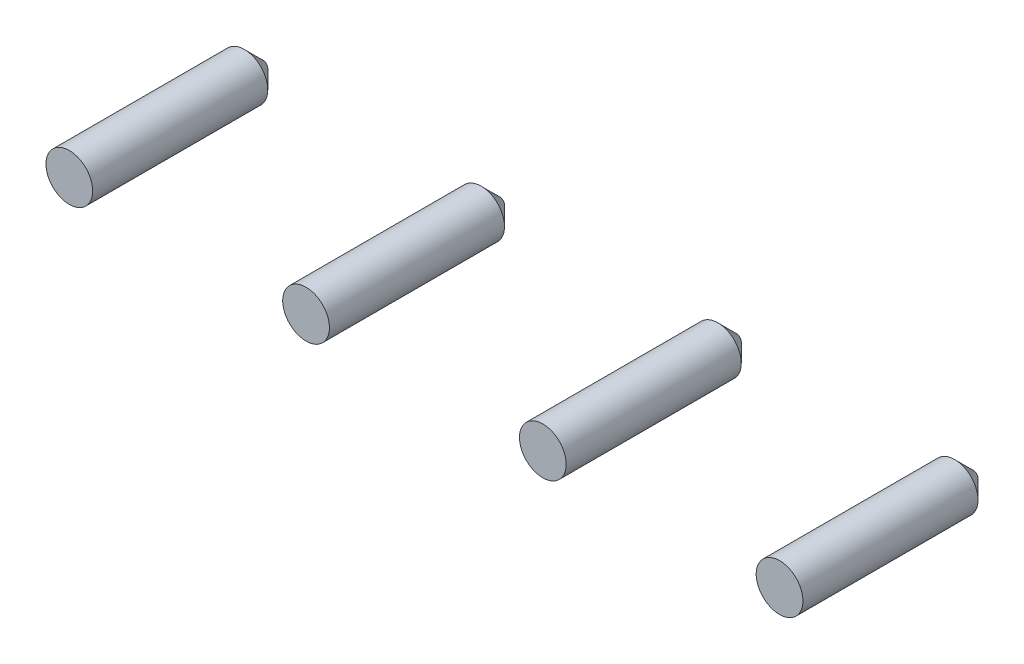
ISO-10303-21;
HEADER;
FILE_DESCRIPTION(('STEP AP214'),'2;1');
FILE_NAME('part.step','',(''),(''),'','','');
FILE_SCHEMA(('AUTOMOTIVE_DESIGN { 1 0 10303 214 1 1 1 1 }'));
ENDSEC;
DATA;
#1=APPLICATION_CONTEXT('core data for automotive mechanical design processes');
#2=APPLICATION_PROTOCOL_DEFINITION('international standard','automotive_design',2000,#1);
#3=PRODUCT_CONTEXT('',#1,'mechanical');
#4=PRODUCT('Part','Part','',(#3));
#5=PRODUCT_RELATED_PRODUCT_CATEGORY('part','',(#4));
#6=PRODUCT_DEFINITION_FORMATION('','',#4);
#7=PRODUCT_DEFINITION_CONTEXT('part definition',#1,'design');
#8=PRODUCT_DEFINITION('design','',#6,#7);
#9=PRODUCT_DEFINITION_SHAPE('','',#8);
#10=(LENGTH_UNIT() NAMED_UNIT(*) SI_UNIT(.MILLI.,.METRE.));
#11=(NAMED_UNIT(*) PLANE_ANGLE_UNIT() SI_UNIT($,.RADIAN.));
#12=(NAMED_UNIT(*) SI_UNIT($,.STERADIAN.) SOLID_ANGLE_UNIT());
#13=UNCERTAINTY_MEASURE_WITH_UNIT(LENGTH_MEASURE(1.E-05),#10,'distance_accuracy_value','');
#14=(GEOMETRIC_REPRESENTATION_CONTEXT(3) GLOBAL_UNCERTAINTY_ASSIGNED_CONTEXT((#13)) GLOBAL_UNIT_ASSIGNED_CONTEXT((#10,
#11,#12)) REPRESENTATION_CONTEXT('',''));
#15=CARTESIAN_POINT('',(0.,0.,0.));
#16=DIRECTION('',(0.,0.,1.));
#17=DIRECTION('',(1.,0.,0.));
#18=AXIS2_PLACEMENT_3D('',#15,#16,#17);
#19=CARTESIAN_POINT('',(0.,0.,-4.064));
#20=DIRECTION('',(0.,0.,1.));
#21=DIRECTION('',(1.,0.,0.));
#22=AXIS2_PLACEMENT_3D('',#19,#20,#21);
#23=PLANE('',#22);
#24=CARTESIAN_POINT('',(0.,0.,-4.064));
#25=DIRECTION('',(0.,0.,1.));
#26=DIRECTION('',(1.,0.,0.));
#27=AXIS2_PLACEMENT_3D('',#24,#25,#26);
#28=CIRCLE('',#27,0.1629);
#29=CARTESIAN_POINT('',(0.1629,0.,-4.064));
#30=VERTEX_POINT('',#29);
#31=EDGE_CURVE('P0_E19',#30,#30,#28,.T.);
#32=ORIENTED_EDGE('',*,*,#31,.F.);
#33=EDGE_LOOP('',(#32));
#34=FACE_BOUND('',#33,.T.);
#35=ADVANCED_FACE('P0_F16',(#34),#23,.F.);
#36=CARTESIAN_POINT('',(0.,0.,2.6924));
#37=DIRECTION('',(0.,0.,1.));
#38=DIRECTION('',(1.,0.,0.));
#39=AXIS2_PLACEMENT_3D('',#36,#37,#38);
#40=PLANE('',#39);
#41=CARTESIAN_POINT('',(0.,0.,2.6924));
#42=DIRECTION('',(0.,0.,1.));
#43=DIRECTION('',(1.,0.,0.));
#44=AXIS2_PLACEMENT_3D('',#41,#42,#43);
#45=CIRCLE('',#44,0.8145);
#46=CARTESIAN_POINT('',(0.8145,0.,2.6924));
#47=VERTEX_POINT('',#46);
#48=EDGE_CURVE('P0_E44',#47,#47,#45,.T.);
#49=ORIENTED_EDGE('',*,*,#48,.T.);
#50=EDGE_LOOP('',(#49));
#51=FACE_BOUND('',#50,.T.);
#52=ADVANCED_FACE('P0_F86',(#51),#40,.T.);
#53=CARTESIAN_POINT('',(0.,0.,-3.4124));
#54=DIRECTION('',(0.,0.,1.));
#55=DIRECTION('',(1.,0.,0.));
#56=AXIS2_PLACEMENT_3D('',#53,#54,#55);
#57=CONICAL_SURFACE('',#56,0.8145,0.785398163397);
#58=ORIENTED_EDGE('',*,*,#31,.T.);
#59=DIRECTION('',(-0.707106781186548,0.,-0.707106781186548));
#60=VECTOR('',#59,1.);
#61=CARTESIAN_POINT('',(0.8145,0.,-3.4124));
#62=LINE('',#61,#60);
#63=CARTESIAN_POINT('',(0.8145,0.,-3.4124));
#64=VERTEX_POINT('',#63);
#65=EDGE_CURVE('P0_E11',#64,#30,#62,.T.);
#66=ORIENTED_EDGE('',*,*,#65,.F.);
#67=CARTESIAN_POINT('',(0.,0.,-3.4124));
#68=DIRECTION('',(0.,0.,1.));
#69=DIRECTION('',(1.,0.,0.));
#70=AXIS2_PLACEMENT_3D('',#67,#68,#69);
#71=CIRCLE('',#70,0.8145);
#72=EDGE_CURVE('P0_E48',#64,#64,#71,.T.);
#73=ORIENTED_EDGE('',*,*,#72,.F.);
#74=ORIENTED_EDGE('',*,*,#65,.T.);
#75=EDGE_LOOP('',(#58,#66,#73,#74));
#76=FACE_BOUND('',#75,.T.);
#77=ADVANCED_FACE('P0_F47',(#76),#57,.T.);
#78=CARTESIAN_POINT('',(0.,0.,-4.064));
#79=DIRECTION('',(0.,0.,1.));
#80=DIRECTION('',(1.,0.,0.));
#81=AXIS2_PLACEMENT_3D('',#78,#79,#80);
#82=CYLINDRICAL_SURFACE('',#81,0.8145);
#83=DIRECTION('',(0.,0.,1.));
#84=VECTOR('',#83,1.);
#85=CARTESIAN_POINT('',(0.8145,0.,-4.064));
#86=LINE('',#85,#84);
#87=EDGE_CURVE('P0_E54',#64,#47,#86,.T.);
#88=ORIENTED_EDGE('',*,*,#87,.T.);
#89=ORIENTED_EDGE('',*,*,#48,.F.);
#90=ORIENTED_EDGE('',*,*,#87,.F.);
#91=ORIENTED_EDGE('',*,*,#72,.T.);
#92=EDGE_LOOP('',(#88,#89,#90,#91));
#93=FACE_BOUND('',#92,.T.);
#94=ADVANCED_FACE('P0_F53',(#93),#82,.T.);
#95=CLOSED_SHELL('',(#35,#52,#77,#94));
#96=MANIFOLD_SOLID_BREP('P0_B1',#95);
#97=CARTESIAN_POINT('',(8.255,0.,-4.064));
#98=DIRECTION('',(0.,0.,1.));
#99=DIRECTION('',(1.,0.,0.));
#100=AXIS2_PLACEMENT_3D('',#97,#98,#99);
#101=PLANE('',#100);
#102=CARTESIAN_POINT('',(8.255,0.,-4.064));
#103=DIRECTION('',(0.,0.,1.));
#104=DIRECTION('',(1.,0.,0.));
#105=AXIS2_PLACEMENT_3D('',#102,#103,#104);
#106=CIRCLE('',#105,0.1629);
#107=CARTESIAN_POINT('',(8.4179,0.,-4.064));
#108=VERTEX_POINT('',#107);
#109=EDGE_CURVE('P1_E26',#108,#108,#106,.T.);
#110=ORIENTED_EDGE('',*,*,#109,.F.);
#111=EDGE_LOOP('',(#110));
#112=FACE_BOUND('',#111,.T.);
#113=ADVANCED_FACE('P1_F16',(#112),#101,.F.);
#114=CARTESIAN_POINT('',(8.255,0.,2.6924));
#115=DIRECTION('',(0.,0.,1.));
#116=DIRECTION('',(1.,0.,0.));
#117=AXIS2_PLACEMENT_3D('',#114,#115,#116);
#118=PLANE('',#117);
#119=CARTESIAN_POINT('',(8.255,0.,2.6924));
#120=DIRECTION('',(0.,0.,1.));
#121=DIRECTION('',(1.,0.,0.));
#122=AXIS2_PLACEMENT_3D('',#119,#120,#121);
#123=CIRCLE('',#122,0.8145);
#124=CARTESIAN_POINT('',(9.0695,0.,2.6924));
#125=VERTEX_POINT('',#124);
#126=EDGE_CURVE('P1_E44',#125,#125,#123,.T.);
#127=ORIENTED_EDGE('',*,*,#126,.T.);
#128=EDGE_LOOP('',(#127));
#129=FACE_BOUND('',#128,.T.);
#130=ADVANCED_FACE('P1_F83',(#129),#118,.T.);
#131=CARTESIAN_POINT('',(8.255,0.,-3.4124));
#132=DIRECTION('',(0.,0.,1.));
#133=DIRECTION('',(1.,0.,0.));
#134=AXIS2_PLACEMENT_3D('',#131,#132,#133);
#135=CONICAL_SURFACE('',#134,0.8145,0.785398163397);
#136=ORIENTED_EDGE('',*,*,#109,.T.);
#137=DIRECTION('',(-0.707106781186548,0.,-0.707106781186548));
#138=VECTOR('',#137,1.);
#139=CARTESIAN_POINT('',(9.0695,0.,-3.4124));
#140=LINE('',#139,#138);
#141=CARTESIAN_POINT('',(9.0695,0.,-3.4124));
#142=VERTEX_POINT('',#141);
#143=EDGE_CURVE('P1_E11',#142,#108,#140,.T.);
#144=ORIENTED_EDGE('',*,*,#143,.F.);
#145=CARTESIAN_POINT('',(8.255,0.,-3.4124));
#146=DIRECTION('',(0.,0.,1.));
#147=DIRECTION('',(1.,0.,0.));
#148=AXIS2_PLACEMENT_3D('',#145,#146,#147);
#149=CIRCLE('',#148,0.8145);
#150=EDGE_CURVE('P1_E49',#142,#142,#149,.T.);
#151=ORIENTED_EDGE('',*,*,#150,.F.);
#152=ORIENTED_EDGE('',*,*,#143,.T.);
#153=EDGE_LOOP('',(#136,#144,#151,#152));
#154=FACE_BOUND('',#153,.T.);
#155=ADVANCED_FACE('P1_F48',(#154),#135,.T.);
#156=CARTESIAN_POINT('',(8.255,0.,-4.064));
#157=DIRECTION('',(0.,0.,1.));
#158=DIRECTION('',(1.,0.,0.));
#159=AXIS2_PLACEMENT_3D('',#156,#157,#158);
#160=CYLINDRICAL_SURFACE('',#159,0.8145);
#161=DIRECTION('',(0.,0.,1.));
#162=VECTOR('',#161,1.);
#163=CARTESIAN_POINT('',(9.0695,0.,-4.064));
#164=LINE('',#163,#162);
#165=EDGE_CURVE('P1_E19',#142,#125,#164,.T.);
#166=ORIENTED_EDGE('',*,*,#165,.T.);
#167=ORIENTED_EDGE('',*,*,#126,.F.);
#168=ORIENTED_EDGE('',*,*,#165,.F.);
#169=ORIENTED_EDGE('',*,*,#150,.T.);
#170=EDGE_LOOP('',(#166,#167,#168,#169));
#171=FACE_BOUND('',#170,.T.);
#172=ADVANCED_FACE('P1_F54',(#171),#160,.T.);
#173=CLOSED_SHELL('',(#113,#130,#155,#172));
#174=MANIFOLD_SOLID_BREP('P1_B1',#173);
#175=CARTESIAN_POINT('',(16.51,0.,-4.064));
#176=DIRECTION('',(0.,0.,1.));
#177=DIRECTION('',(1.,0.,0.));
#178=AXIS2_PLACEMENT_3D('',#175,#176,#177);
#179=PLANE('',#178);
#180=CARTESIAN_POINT('',(16.51,0.,-4.064));
#181=DIRECTION('',(0.,0.,1.));
#182=DIRECTION('',(1.,0.,0.));
#183=AXIS2_PLACEMENT_3D('',#180,#181,#182);
#184=CIRCLE('',#183,0.1629);
#185=CARTESIAN_POINT('',(16.6729,0.,-4.064));
#186=VERTEX_POINT('',#185);
#187=EDGE_CURVE('P2_E20',#186,#186,#184,.T.);
#188=ORIENTED_EDGE('',*,*,#187,.F.);
#189=EDGE_LOOP('',(#188));
#190=FACE_BOUND('',#189,.T.);
#191=ADVANCED_FACE('P2_F16',(#190),#179,.F.);
#192=CARTESIAN_POINT('',(16.51,0.,2.6924));
#193=DIRECTION('',(0.,0.,1.));
#194=DIRECTION('',(1.,0.,0.));
#195=AXIS2_PLACEMENT_3D('',#192,#193,#194);
#196=PLANE('',#195);
#197=CARTESIAN_POINT('',(16.51,0.,2.6924));
#198=DIRECTION('',(0.,0.,1.));
#199=DIRECTION('',(1.,0.,0.));
#200=AXIS2_PLACEMENT_3D('',#197,#198,#199);
#201=CIRCLE('',#200,0.8145);
#202=CARTESIAN_POINT('',(17.3245,0.,2.6924));
#203=VERTEX_POINT('',#202);
#204=EDGE_CURVE('P2_E45',#203,#203,#201,.T.);
#205=ORIENTED_EDGE('',*,*,#204,.T.);
#206=EDGE_LOOP('',(#205));
#207=FACE_BOUND('',#206,.T.);
#208=ADVANCED_FACE('P2_F18',(#207),#196,.T.);
#209=CARTESIAN_POINT('',(16.51,0.,-3.4124));
#210=DIRECTION('',(0.,0.,1.));
#211=DIRECTION('',(1.,0.,0.));
#212=AXIS2_PLACEMENT_3D('',#209,#210,#211);
#213=CONICAL_SURFACE('',#212,0.8145,0.785398163397);
#214=ORIENTED_EDGE('',*,*,#187,.T.);
#215=DIRECTION('',(-0.707106781186548,0.,-0.707106781186548));
#216=VECTOR('',#215,1.);
#217=CARTESIAN_POINT('',(17.3245,0.,-3.4124));
#218=LINE('',#217,#216);
#219=CARTESIAN_POINT('',(17.3245,0.,-3.4124));
#220=VERTEX_POINT('',#219);
#221=EDGE_CURVE('P2_E11',#220,#186,#218,.T.);
#222=ORIENTED_EDGE('',*,*,#221,.F.);
#223=CARTESIAN_POINT('',(16.51,0.,-3.4124));
#224=DIRECTION('',(0.,0.,1.));
#225=DIRECTION('',(1.,0.,0.));
#226=AXIS2_PLACEMENT_3D('',#223,#224,#225);
#227=CIRCLE('',#226,0.8145);
#228=EDGE_CURVE('P2_E49',#220,#220,#227,.T.);
#229=ORIENTED_EDGE('',*,*,#228,.F.);
#230=ORIENTED_EDGE('',*,*,#221,.T.);
#231=EDGE_LOOP('',(#214,#222,#229,#230));
#232=FACE_BOUND('',#231,.T.);
#233=ADVANCED_FACE('P2_F48',(#232),#213,.T.);
#234=CARTESIAN_POINT('',(16.51,0.,-4.064));
#235=DIRECTION('',(0.,0.,1.));
#236=DIRECTION('',(1.,0.,0.));
#237=AXIS2_PLACEMENT_3D('',#234,#235,#236);
#238=CYLINDRICAL_SURFACE('',#237,0.8145);
#239=DIRECTION('',(0.,0.,1.));
#240=VECTOR('',#239,1.);
#241=CARTESIAN_POINT('',(17.3245,0.,-4.064));
#242=LINE('',#241,#240);
#243=EDGE_CURVE('P2_E55',#220,#203,#242,.T.);
#244=ORIENTED_EDGE('',*,*,#243,.T.);
#245=ORIENTED_EDGE('',*,*,#204,.F.);
#246=ORIENTED_EDGE('',*,*,#243,.F.);
#247=ORIENTED_EDGE('',*,*,#228,.T.);
#248=EDGE_LOOP('',(#244,#245,#246,#247));
#249=FACE_BOUND('',#248,.T.);
#250=ADVANCED_FACE('P2_F54',(#249),#238,.T.);
#251=CLOSED_SHELL('',(#191,#208,#233,#250));
#252=MANIFOLD_SOLID_BREP('P2_B1',#251);
#253=CARTESIAN_POINT('',(24.765,0.,-4.064));
#254=DIRECTION('',(0.,0.,1.));
#255=DIRECTION('',(1.,0.,0.));
#256=AXIS2_PLACEMENT_3D('',#253,#254,#255);
#257=PLANE('',#256);
#258=CARTESIAN_POINT('',(24.765,0.,-4.064));
#259=DIRECTION('',(0.,0.,1.));
#260=DIRECTION('',(1.,0.,0.));
#261=AXIS2_PLACEMENT_3D('',#258,#259,#260);
#262=CIRCLE('',#261,0.1629);
#263=CARTESIAN_POINT('',(24.9279,0.,-4.064));
#264=VERTEX_POINT('',#263);
#265=EDGE_CURVE('P3_E20',#264,#264,#262,.T.);
#266=ORIENTED_EDGE('',*,*,#265,.F.);
#267=EDGE_LOOP('',(#266));
#268=FACE_BOUND('',#267,.T.);
#269=ADVANCED_FACE('P3_F16',(#268),#257,.F.);
#270=CARTESIAN_POINT('',(24.765,0.,2.6924));
#271=DIRECTION('',(0.,0.,1.));
#272=DIRECTION('',(1.,0.,0.));
#273=AXIS2_PLACEMENT_3D('',#270,#271,#272);
#274=PLANE('',#273);
#275=CARTESIAN_POINT('',(24.765,0.,2.6924));
#276=DIRECTION('',(0.,0.,1.));
#277=DIRECTION('',(1.,0.,0.));
#278=AXIS2_PLACEMENT_3D('',#275,#276,#277);
#279=CIRCLE('',#278,0.8145);
#280=CARTESIAN_POINT('',(25.5795,0.,2.6924));
#281=VERTEX_POINT('',#280);
#282=EDGE_CURVE('P3_E44',#281,#281,#279,.T.);
#283=ORIENTED_EDGE('',*,*,#282,.T.);
#284=EDGE_LOOP('',(#283));
#285=FACE_BOUND('',#284,.T.);
#286=ADVANCED_FACE('P3_F18',(#285),#274,.T.);
#287=CARTESIAN_POINT('',(24.765,0.,-3.4124));
#288=DIRECTION('',(0.,0.,1.));
#289=DIRECTION('',(1.,0.,0.));
#290=AXIS2_PLACEMENT_3D('',#287,#288,#289);
#291=CONICAL_SURFACE('',#290,0.8145,0.785398163397);
#292=ORIENTED_EDGE('',*,*,#265,.T.);
#293=DIRECTION('',(-0.707106781186548,0.,-0.707106781186548));
#294=VECTOR('',#293,1.);
#295=CARTESIAN_POINT('',(25.5795,0.,-3.4124));
#296=LINE('',#295,#294);
#297=CARTESIAN_POINT('',(25.5795,0.,-3.4124));
#298=VERTEX_POINT('',#297);
#299=EDGE_CURVE('P3_E11',#298,#264,#296,.T.);
#300=ORIENTED_EDGE('',*,*,#299,.F.);
#301=CARTESIAN_POINT('',(24.765,0.,-3.4124));
#302=DIRECTION('',(0.,0.,1.));
#303=DIRECTION('',(1.,0.,0.));
#304=AXIS2_PLACEMENT_3D('',#301,#302,#303);
#305=CIRCLE('',#304,0.8145);
#306=EDGE_CURVE('P3_E49',#298,#298,#305,.T.);
#307=ORIENTED_EDGE('',*,*,#306,.F.);
#308=ORIENTED_EDGE('',*,*,#299,.T.);
#309=EDGE_LOOP('',(#292,#300,#307,#308));
#310=FACE_BOUND('',#309,.T.);
#311=ADVANCED_FACE('P3_F48',(#310),#291,.T.);
#312=CARTESIAN_POINT('',(24.765,0.,-4.064));
#313=DIRECTION('',(0.,0.,1.));
#314=DIRECTION('',(1.,0.,0.));
#315=AXIS2_PLACEMENT_3D('',#312,#313,#314);
#316=CYLINDRICAL_SURFACE('',#315,0.8145);
#317=DIRECTION('',(0.,0.,1.));
#318=VECTOR('',#317,1.);
#319=CARTESIAN_POINT('',(25.5795,0.,-4.064));
#320=LINE('',#319,#318);
#321=EDGE_CURVE('P3_E55',#298,#281,#320,.T.);
#322=ORIENTED_EDGE('',*,*,#321,.T.);
#323=ORIENTED_EDGE('',*,*,#282,.F.);
#324=ORIENTED_EDGE('',*,*,#321,.F.);
#325=ORIENTED_EDGE('',*,*,#306,.T.);
#326=EDGE_LOOP('',(#322,#323,#324,#325));
#327=FACE_BOUND('',#326,.T.);
#328=ADVANCED_FACE('P3_F54',(#327),#316,.T.);
#329=CLOSED_SHELL('',(#269,#286,#311,#328));
#330=MANIFOLD_SOLID_BREP('P3_B1',#329);
#331=ADVANCED_BREP_SHAPE_REPRESENTATION('',(#18,#96,#174,#252,#330),#14);
#332=SHAPE_DEFINITION_REPRESENTATION(#9,#331);
ENDSEC;
END-ISO-10303-21;
